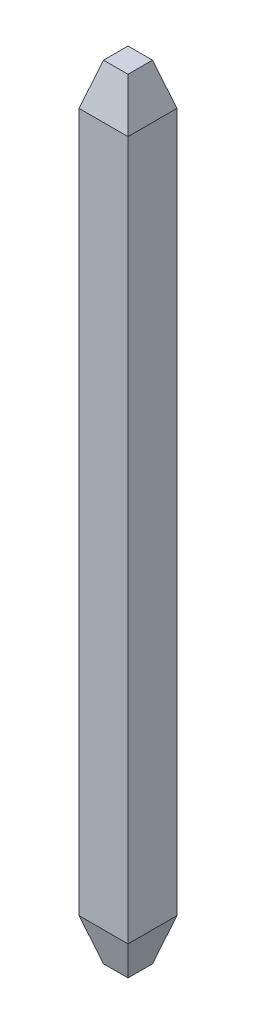
ISO-10303-21;
HEADER;
FILE_DESCRIPTION(('STEP AP214'),'2;1');
FILE_NAME('part.step','',(''),(''),'','','');
FILE_SCHEMA(('AUTOMOTIVE_DESIGN { 1 0 10303 214 1 1 1 1 }'));
ENDSEC;
DATA;
#1=APPLICATION_CONTEXT('core data for automotive mechanical design processes');
#2=APPLICATION_PROTOCOL_DEFINITION('international standard','automotive_design',2000,#1);
#3=PRODUCT_CONTEXT('',#1,'mechanical');
#4=PRODUCT('Part','Part','',(#3));
#5=PRODUCT_RELATED_PRODUCT_CATEGORY('part','',(#4));
#6=PRODUCT_DEFINITION_FORMATION('','',#4);
#7=PRODUCT_DEFINITION_CONTEXT('part definition',#1,'design');
#8=PRODUCT_DEFINITION('design','',#6,#7);
#9=PRODUCT_DEFINITION_SHAPE('','',#8);
#10=(LENGTH_UNIT() NAMED_UNIT(*) SI_UNIT(.MILLI.,.METRE.));
#11=(NAMED_UNIT(*) PLANE_ANGLE_UNIT() SI_UNIT($,.RADIAN.));
#12=(NAMED_UNIT(*) SI_UNIT($,.STERADIAN.) SOLID_ANGLE_UNIT());
#13=UNCERTAINTY_MEASURE_WITH_UNIT(LENGTH_MEASURE(1.E-05),#10,'distance_accuracy_value','');
#14=(GEOMETRIC_REPRESENTATION_CONTEXT(3) GLOBAL_UNCERTAINTY_ASSIGNED_CONTEXT((#13)) GLOBAL_UNIT_ASSIGNED_CONTEXT((#10,
#11,#12)) REPRESENTATION_CONTEXT('',''));
#15=CARTESIAN_POINT('',(0.,0.,0.));
#16=DIRECTION('',(0.,0.,1.));
#17=DIRECTION('',(1.,0.,0.));
#18=AXIS2_PLACEMENT_3D('',#15,#16,#17);
#19=CARTESIAN_POINT('',(-3.32899999998701,-5.53443505344793,-17.2999999999763));
#20=DIRECTION('',(0.,0.,-1.));
#21=DIRECTION('',(0.,-1.,0.));
#22=AXIS2_PLACEMENT_3D('',#19,#20,#21);
#23=PLANE('',#22);
#24=DIRECTION('',(0.,1.,0.));
#25=VECTOR('',#24,1.);
#26=CARTESIAN_POINT('',(-3.32999999998702,-10.1039999999832,-17.2999999999763));
#27=LINE('',#26,#25);
#28=CARTESIAN_POINT('',(-3.32999999998705,-10.1039999999832,-17.2999999999763));
#29=VERTEX_POINT('',#28);
#30=CARTESIAN_POINT('',(-3.32999999998705,-0.965870106912663,-17.2999999999763));
#31=VERTEX_POINT('',#30);
#32=EDGE_CURVE('E167',#29,#31,#27,.T.);
#33=ORIENTED_EDGE('',*,*,#32,.F.);
#34=DIRECTION('',(1.,0.,0.));
#35=VECTOR('',#34,1.);
#36=CARTESIAN_POINT('',(-3.96999999998703,-10.1039999999832,-17.2999999999763));
#37=LINE('',#36,#35);
#38=CARTESIAN_POINT('',(-3.96999999998703,-10.1039999999832,-17.2999999999763));
#39=VERTEX_POINT('',#38);
#40=EDGE_CURVE('E41',#39,#29,#37,.T.);
#41=ORIENTED_EDGE('',*,*,#40,.F.);
#42=DIRECTION('',(0.,1.,0.));
#43=VECTOR('',#42,1.);
#44=CARTESIAN_POINT('',(-3.96999999998703,-10.1039999999832,-17.2999999999763));
#45=LINE('',#44,#43);
#46=CARTESIAN_POINT('',(-3.96999999998703,-0.965870106912663,-17.2999999999763));
#47=VERTEX_POINT('',#46);
#48=EDGE_CURVE('E11',#39,#47,#45,.T.);
#49=ORIENTED_EDGE('',*,*,#48,.T.);
#50=DIRECTION('',(1.,0.,0.));
#51=VECTOR('',#50,1.);
#52=CARTESIAN_POINT('',(-3.96999999998703,-0.965870106912661,-17.2999999999763));
#53=LINE('',#52,#51);
#54=EDGE_CURVE('E28',#47,#31,#53,.T.);
#55=ORIENTED_EDGE('',*,*,#54,.T.);
#56=EDGE_LOOP('',(#33,#41,#49,#55));
#57=FACE_BOUND('',#56,.T.);
#58=ADVANCED_FACE('F17',(#57),#23,.T.);
#59=CARTESIAN_POINT('',(-3.32999999998702,-11.0738701069127,-16.9799999999763));
#60=DIRECTION('',(1.,0.,0.));
#61=DIRECTION('',(0.,1.,0.));
#62=AXIS2_PLACEMENT_3D('',#59,#60,#61);
#63=PLANE('',#62);
#64=DIRECTION('',(0.,1.,0.));
#65=VECTOR('',#64,1.);
#66=CARTESIAN_POINT('',(-3.32999999998702,-10.1039999999832,-16.6599999999763));
#67=LINE('',#66,#65);
#68=CARTESIAN_POINT('',(-3.32999999998705,-10.1039999999832,-16.6599999999763));
#69=VERTEX_POINT('',#68);
#70=CARTESIAN_POINT('',(-3.32999999998705,-0.965870106912663,-16.6599999999763));
#71=VERTEX_POINT('',#70);
#72=EDGE_CURVE('E121',#69,#71,#67,.T.);
#73=ORIENTED_EDGE('',*,*,#72,.F.);
#74=DIRECTION('',(0.,0.,1.));
#75=VECTOR('',#74,1.);
#76=CARTESIAN_POINT('',(-3.32999999998702,-10.1039999999832,-17.2999999999763));
#77=LINE('',#76,#75);
#78=EDGE_CURVE('E100',#29,#69,#77,.T.);
#79=ORIENTED_EDGE('',*,*,#78,.F.);
#80=ORIENTED_EDGE('',*,*,#32,.T.);
#81=DIRECTION('',(0.,0.,1.));
#82=VECTOR('',#81,1.);
#83=CARTESIAN_POINT('',(-3.32999999998702,-0.965870106912661,-17.2999999999763));
#84=LINE('',#83,#82);
#85=EDGE_CURVE('E133',#31,#71,#84,.T.);
#86=ORIENTED_EDGE('',*,*,#85,.T.);
#87=EDGE_LOOP('',(#73,#79,#80,#86));
#88=FACE_BOUND('',#87,.T.);
#89=ADVANCED_FACE('F132',(#88),#63,.T.);
#90=CARTESIAN_POINT('',(-3.97099999998701,-5.53543505344793,-16.6599999999763));
#91=DIRECTION('',(0.,0.,1.));
#92=DIRECTION('',(1.,0.,0.));
#93=AXIS2_PLACEMENT_3D('',#90,#91,#92);
#94=PLANE('',#93);
#95=DIRECTION('',(0.,1.,0.));
#96=VECTOR('',#95,1.);
#97=CARTESIAN_POINT('',(-3.96999999998703,-10.1039999999832,-16.6599999999763));
#98=LINE('',#97,#96);
#99=CARTESIAN_POINT('',(-3.96999999998703,-10.1039999999832,-16.6599999999763));
#100=VERTEX_POINT('',#99);
#101=CARTESIAN_POINT('',(-3.96999999998703,-0.965870106912663,-16.6599999999763));
#102=VERTEX_POINT('',#101);
#103=EDGE_CURVE('E123',#100,#102,#98,.T.);
#104=ORIENTED_EDGE('',*,*,#103,.F.);
#105=DIRECTION('',(-1.,0.,0.));
#106=VECTOR('',#105,1.);
#107=CARTESIAN_POINT('',(-3.32999999998702,-10.1039999999832,-16.6599999999763));
#108=LINE('',#107,#106);
#109=EDGE_CURVE('E118',#69,#100,#108,.T.);
#110=ORIENTED_EDGE('',*,*,#109,.F.);
#111=ORIENTED_EDGE('',*,*,#72,.T.);
#112=DIRECTION('',(-1.,0.,0.));
#113=VECTOR('',#112,1.);
#114=CARTESIAN_POINT('',(-3.32999999998702,-0.965870106912661,-16.6599999999763));
#115=LINE('',#114,#113);
#116=EDGE_CURVE('E136',#71,#102,#115,.T.);
#117=ORIENTED_EDGE('',*,*,#116,.T.);
#118=EDGE_LOOP('',(#104,#110,#111,#117));
#119=FACE_BOUND('',#118,.T.);
#120=ADVANCED_FACE('F119',(#119),#94,.T.);
#121=CARTESIAN_POINT('',(-3.64999999998703,-0.965870106912661,-16.6599999999763));
#122=DIRECTION('',(0.,0.281214622974643,0.959644900900968));
#123=DIRECTION('',(1.,0.,0.));
#124=AXIS2_PLACEMENT_3D('',#121,#122,#123);
#125=PLANE('',#124);
#126=DIRECTION('',(-0.270714017147711,0.923811583516622,-0.270714017147728));
#127=VECTOR('',#126,1.);
#128=CARTESIAN_POINT('',(-3.32999999998702,-0.965870106912661,-16.6599999999763));
#129=LINE('',#128,#127);
#130=CARTESIAN_POINT('',(-3.48999999998704,-0.419870106912663,-16.8199999999763));
#131=VERTEX_POINT('',#130);
#132=EDGE_CURVE('E181',#71,#131,#129,.T.);
#133=ORIENTED_EDGE('',*,*,#132,.T.);
#134=DIRECTION('',(-1.,0.,0.));
#135=VECTOR('',#134,1.);
#136=CARTESIAN_POINT('',(-3.48999999998701,-0.419870106912661,-16.8199999999763));
#137=LINE('',#136,#135);
#138=CARTESIAN_POINT('',(-3.80999999998703,-0.419870106912663,-16.8199999999763));
#139=VERTEX_POINT('',#138);
#140=EDGE_CURVE('E21',#131,#139,#137,.T.);
#141=ORIENTED_EDGE('',*,*,#140,.T.);
#142=DIRECTION('',(0.270714017147727,0.923811583516618,-0.270714017147727));
#143=VECTOR('',#142,1.);
#144=CARTESIAN_POINT('',(-3.96999999998703,-0.965870106912661,-16.6599999999763));
#145=LINE('',#144,#143);
#146=EDGE_CURVE('E175',#102,#139,#145,.T.);
#147=ORIENTED_EDGE('',*,*,#146,.F.);
#148=ORIENTED_EDGE('',*,*,#116,.F.);
#149=EDGE_LOOP('',(#133,#141,#147,#148));
#150=FACE_BOUND('',#149,.T.);
#151=ADVANCED_FACE('F241',(#150),#125,.T.);
#152=CARTESIAN_POINT('',(-3.96999999998703,-0.965870106912661,-16.9799999999763));
#153=DIRECTION('',(-0.959644900900968,0.281214622974643,0.));
#154=DIRECTION('',(0.,0.,1.));
#155=AXIS2_PLACEMENT_3D('',#152,#153,#154);
#156=PLANE('',#155);
#157=ORIENTED_EDGE('',*,*,#146,.T.);
#158=DIRECTION('',(0.,0.,-1.));
#159=VECTOR('',#158,1.);
#160=CARTESIAN_POINT('',(-3.80999999998703,-0.419870106912661,-16.8199999999763));
#161=LINE('',#160,#159);
#162=CARTESIAN_POINT('',(-3.80999999998703,-0.419870106912663,-17.1399999999763));
#163=VERTEX_POINT('',#162);
#164=EDGE_CURVE('E129',#139,#163,#161,.T.);
#165=ORIENTED_EDGE('',*,*,#164,.T.);
#166=DIRECTION('',(0.270714017147727,0.923811583516618,0.270714017147727));
#167=VECTOR('',#166,1.);
#168=CARTESIAN_POINT('',(-3.96999999998703,-0.965870106912661,-17.2999999999763));
#169=LINE('',#168,#167);
#170=EDGE_CURVE('E141',#47,#163,#169,.T.);
#171=ORIENTED_EDGE('',*,*,#170,.F.);
#172=DIRECTION('',(0.,0.,-1.));
#173=VECTOR('',#172,1.);
#174=CARTESIAN_POINT('',(-3.96999999998703,-0.965870106912661,-16.6599999999763));
#175=LINE('',#174,#173);
#176=EDGE_CURVE('E189',#102,#47,#175,.T.);
#177=ORIENTED_EDGE('',*,*,#176,.F.);
#178=EDGE_LOOP('',(#157,#165,#171,#177));
#179=FACE_BOUND('',#178,.T.);
#180=ADVANCED_FACE('F244',(#179),#156,.T.);
#181=CARTESIAN_POINT('',(-3.64999999998703,-0.419870106912661,-17.1409999999763));
#182=DIRECTION('',(0.,1.,0.));
#183=DIRECTION('',(1.,0.,0.));
#184=AXIS2_PLACEMENT_3D('',#181,#182,#183);
#185=PLANE('',#184);
#186=DIRECTION('',(1.,0.,0.));
#187=VECTOR('',#186,1.);
#188=CARTESIAN_POINT('',(-3.80999999998703,-0.419870106912661,-17.1399999999763));
#189=LINE('',#188,#187);
#190=CARTESIAN_POINT('',(-3.48999999998704,-0.419870106912663,-17.1399999999763));
#191=VERTEX_POINT('',#190);
#192=EDGE_CURVE('E147',#163,#191,#189,.T.);
#193=ORIENTED_EDGE('',*,*,#192,.F.);
#194=ORIENTED_EDGE('',*,*,#164,.F.);
#195=ORIENTED_EDGE('',*,*,#140,.F.);
#196=DIRECTION('',(0.,0.,1.));
#197=VECTOR('',#196,1.);
#198=CARTESIAN_POINT('',(-3.48999999998701,-0.419870106912661,-17.1399999999763));
#199=LINE('',#198,#197);
#200=EDGE_CURVE('E113',#191,#131,#199,.T.);
#201=ORIENTED_EDGE('',*,*,#200,.F.);
#202=EDGE_LOOP('',(#193,#194,#195,#201));
#203=FACE_BOUND('',#202,.T.);
#204=ADVANCED_FACE('F223',(#203),#185,.T.);
#205=CARTESIAN_POINT('',(-3.64999999998703,-10.1039999999832,-16.6599999999763));
#206=DIRECTION('',(0.,-0.281214622974643,0.959644900900968));
#207=DIRECTION('',(-1.,0.,0.));
#208=AXIS2_PLACEMENT_3D('',#205,#206,#207);
#209=PLANE('',#208);
#210=ORIENTED_EDGE('',*,*,#109,.T.);
#211=DIRECTION('',(0.270714017147727,-0.923811583516618,-0.270714017147727));
#212=VECTOR('',#211,1.);
#213=CARTESIAN_POINT('',(-3.96999999998703,-10.1039999999832,-16.6599999999763));
#214=LINE('',#213,#212);
#215=CARTESIAN_POINT('',(-3.80999999998703,-10.6499999999832,-16.8199999999763));
#216=VERTEX_POINT('',#215);
#217=EDGE_CURVE('E130',#100,#216,#214,.T.);
#218=ORIENTED_EDGE('',*,*,#217,.T.);
#219=DIRECTION('',(-1.,0.,0.));
#220=VECTOR('',#219,1.);
#221=CARTESIAN_POINT('',(-3.48999999998701,-10.6499999999832,-16.8199999999763));
#222=LINE('',#221,#220);
#223=CARTESIAN_POINT('',(-3.48999999998704,-10.6499999999832,-16.8199999999763));
#224=VERTEX_POINT('',#223);
#225=EDGE_CURVE('E138',#224,#216,#222,.T.);
#226=ORIENTED_EDGE('',*,*,#225,.F.);
#227=DIRECTION('',(-0.270714017147711,-0.923811583516622,-0.270714017147728));
#228=VECTOR('',#227,1.);
#229=CARTESIAN_POINT('',(-3.32999999998702,-10.1039999999832,-16.6599999999763));
#230=LINE('',#229,#228);
#231=EDGE_CURVE('E105',#69,#224,#230,.T.);
#232=ORIENTED_EDGE('',*,*,#231,.F.);
#233=EDGE_LOOP('',(#210,#218,#226,#232));
#234=FACE_BOUND('',#233,.T.);
#235=ADVANCED_FACE('F19',(#234),#209,.T.);
#236=CARTESIAN_POINT('',(-3.81099999998701,-10.6499999999832,-16.9799999999763));
#237=DIRECTION('',(0.,-1.,0.));
#238=DIRECTION('',(0.,0.,-1.));
#239=AXIS2_PLACEMENT_3D('',#236,#237,#238);
#240=PLANE('',#239);
#241=DIRECTION('',(0.,0.,1.));
#242=VECTOR('',#241,1.);
#243=CARTESIAN_POINT('',(-3.48999999998701,-10.6499999999832,-17.1399999999763));
#244=LINE('',#243,#242);
#245=CARTESIAN_POINT('',(-3.48999999998704,-10.6499999999832,-17.1399999999763));
#246=VERTEX_POINT('',#245);
#247=EDGE_CURVE('E152',#246,#224,#244,.T.);
#248=ORIENTED_EDGE('',*,*,#247,.T.);
#249=ORIENTED_EDGE('',*,*,#225,.T.);
#250=DIRECTION('',(0.,0.,-1.));
#251=VECTOR('',#250,1.);
#252=CARTESIAN_POINT('',(-3.80999999998703,-10.6499999999832,-16.8199999999763));
#253=LINE('',#252,#251);
#254=CARTESIAN_POINT('',(-3.80999999998703,-10.6499999999832,-17.1399999999763));
#255=VERTEX_POINT('',#254);
#256=EDGE_CURVE('E180',#216,#255,#253,.T.);
#257=ORIENTED_EDGE('',*,*,#256,.T.);
#258=DIRECTION('',(1.,0.,0.));
#259=VECTOR('',#258,1.);
#260=CARTESIAN_POINT('',(-3.80999999998703,-10.6499999999832,-17.1399999999763));
#261=LINE('',#260,#259);
#262=EDGE_CURVE('E185',#255,#246,#261,.T.);
#263=ORIENTED_EDGE('',*,*,#262,.T.);
#264=EDGE_LOOP('',(#248,#249,#257,#263));
#265=FACE_BOUND('',#264,.T.);
#266=ADVANCED_FACE('F212',(#265),#240,.T.);
#267=CARTESIAN_POINT('',(-3.96999999998703,-10.1039999999832,-16.9799999999763));
#268=DIRECTION('',(-0.959644900900968,-0.281214622974643,0.));
#269=DIRECTION('',(-0.281214622974643,0.959644900900968,0.));
#270=AXIS2_PLACEMENT_3D('',#267,#268,#269);
#271=PLANE('',#270);
#272=DIRECTION('',(0.,0.,-1.));
#273=VECTOR('',#272,1.);
#274=CARTESIAN_POINT('',(-3.96999999998703,-10.1039999999832,-16.6599999999763));
#275=LINE('',#274,#273);
#276=EDGE_CURVE('E159',#100,#39,#275,.T.);
#277=ORIENTED_EDGE('',*,*,#276,.T.);
#278=DIRECTION('',(0.270714017147727,-0.923811583516618,0.270714017147727));
#279=VECTOR('',#278,1.);
#280=CARTESIAN_POINT('',(-3.96999999998703,-10.1039999999832,-17.2999999999763));
#281=LINE('',#280,#279);
#282=EDGE_CURVE('E155',#39,#255,#281,.T.);
#283=ORIENTED_EDGE('',*,*,#282,.T.);
#284=ORIENTED_EDGE('',*,*,#256,.F.);
#285=ORIENTED_EDGE('',*,*,#217,.F.);
#286=EDGE_LOOP('',(#277,#283,#284,#285));
#287=FACE_BOUND('',#286,.T.);
#288=ADVANCED_FACE('F203',(#287),#271,.T.);
#289=CARTESIAN_POINT('',(-3.32999999998702,-0.965870106912661,-16.9799999999763));
#290=DIRECTION('',(0.959644900900973,0.281214622974627,0.));
#291=DIRECTION('',(0.,0.,-1.));
#292=AXIS2_PLACEMENT_3D('',#289,#290,#291);
#293=PLANE('',#292);
#294=DIRECTION('',(-0.270714017147711,0.923811583516622,0.270714017147728));
#295=VECTOR('',#294,1.);
#296=CARTESIAN_POINT('',(-3.32999999998702,-0.965870106912661,-17.2999999999763));
#297=LINE('',#296,#295);
#298=EDGE_CURVE('E160',#31,#191,#297,.T.);
#299=ORIENTED_EDGE('',*,*,#298,.T.);
#300=ORIENTED_EDGE('',*,*,#200,.T.);
#301=ORIENTED_EDGE('',*,*,#132,.F.);
#302=ORIENTED_EDGE('',*,*,#85,.F.);
#303=EDGE_LOOP('',(#299,#300,#301,#302));
#304=FACE_BOUND('',#303,.T.);
#305=ADVANCED_FACE('F221',(#304),#293,.T.);
#306=CARTESIAN_POINT('',(-3.32999999998702,-10.1039999999832,-16.9799999999763));
#307=DIRECTION('',(0.959644900900973,-0.281214622974627,0.));
#308=DIRECTION('',(0.,0.,-1.));
#309=AXIS2_PLACEMENT_3D('',#306,#307,#308);
#310=PLANE('',#309);
#311=ORIENTED_EDGE('',*,*,#78,.T.);
#312=ORIENTED_EDGE('',*,*,#231,.T.);
#313=ORIENTED_EDGE('',*,*,#247,.F.);
#314=DIRECTION('',(-0.270714017147711,-0.923811583516622,0.270714017147728));
#315=VECTOR('',#314,1.);
#316=CARTESIAN_POINT('',(-3.32999999998702,-10.1039999999832,-17.2999999999763));
#317=LINE('',#316,#315);
#318=EDGE_CURVE('E107',#29,#246,#317,.T.);
#319=ORIENTED_EDGE('',*,*,#318,.F.);
#320=EDGE_LOOP('',(#311,#312,#313,#319));
#321=FACE_BOUND('',#320,.T.);
#322=ADVANCED_FACE('F102',(#321),#310,.T.);
#323=CARTESIAN_POINT('',(-3.64999999998703,-0.965870106912661,-17.2999999999763));
#324=DIRECTION('',(0.,0.281214622974643,-0.959644900900968));
#325=DIRECTION('',(-1.,0.,0.));
#326=AXIS2_PLACEMENT_3D('',#323,#324,#325);
#327=PLANE('',#326);
#328=ORIENTED_EDGE('',*,*,#170,.T.);
#329=ORIENTED_EDGE('',*,*,#192,.T.);
#330=ORIENTED_EDGE('',*,*,#298,.F.);
#331=ORIENTED_EDGE('',*,*,#54,.F.);
#332=EDGE_LOOP('',(#328,#329,#330,#331));
#333=FACE_BOUND('',#332,.T.);
#334=ADVANCED_FACE('F237',(#333),#327,.T.);
#335=CARTESIAN_POINT('',(-3.96999999998703,-5.53543505344793,-16.6589999999763));
#336=DIRECTION('',(-1.,0.,0.));
#337=DIRECTION('',(0.,0.,1.));
#338=AXIS2_PLACEMENT_3D('',#335,#336,#337);
#339=PLANE('',#338);
#340=ORIENTED_EDGE('',*,*,#48,.F.);
#341=ORIENTED_EDGE('',*,*,#276,.F.);
#342=ORIENTED_EDGE('',*,*,#103,.T.);
#343=ORIENTED_EDGE('',*,*,#176,.T.);
#344=EDGE_LOOP('',(#340,#341,#342,#343));
#345=FACE_BOUND('',#344,.T.);
#346=ADVANCED_FACE('F207',(#345),#339,.T.);
#347=CARTESIAN_POINT('',(-3.64999999998703,-10.1039999999832,-17.2999999999763));
#348=DIRECTION('',(0.,-0.281214622974643,-0.959644900900968));
#349=DIRECTION('',(0.,-0.959644900900968,0.281214622974643));
#350=AXIS2_PLACEMENT_3D('',#347,#348,#349);
#351=PLANE('',#350);
#352=ORIENTED_EDGE('',*,*,#40,.T.);
#353=ORIENTED_EDGE('',*,*,#318,.T.);
#354=ORIENTED_EDGE('',*,*,#262,.F.);
#355=ORIENTED_EDGE('',*,*,#282,.F.);
#356=EDGE_LOOP('',(#352,#353,#354,#355));
#357=FACE_BOUND('',#356,.T.);
#358=ADVANCED_FACE('F210',(#357),#351,.T.);
#359=CLOSED_SHELL('',(#58,#89,#120,#151,#180,#204,#235,#266,#288,#305,#322,#334,#346,#358));
#360=MANIFOLD_SOLID_BREP('B1',#359);
#361=ADVANCED_BREP_SHAPE_REPRESENTATION('',(#18,#360),#14);
#362=SHAPE_DEFINITION_REPRESENTATION(#9,#361);
ENDSEC;
END-ISO-10303-21;
